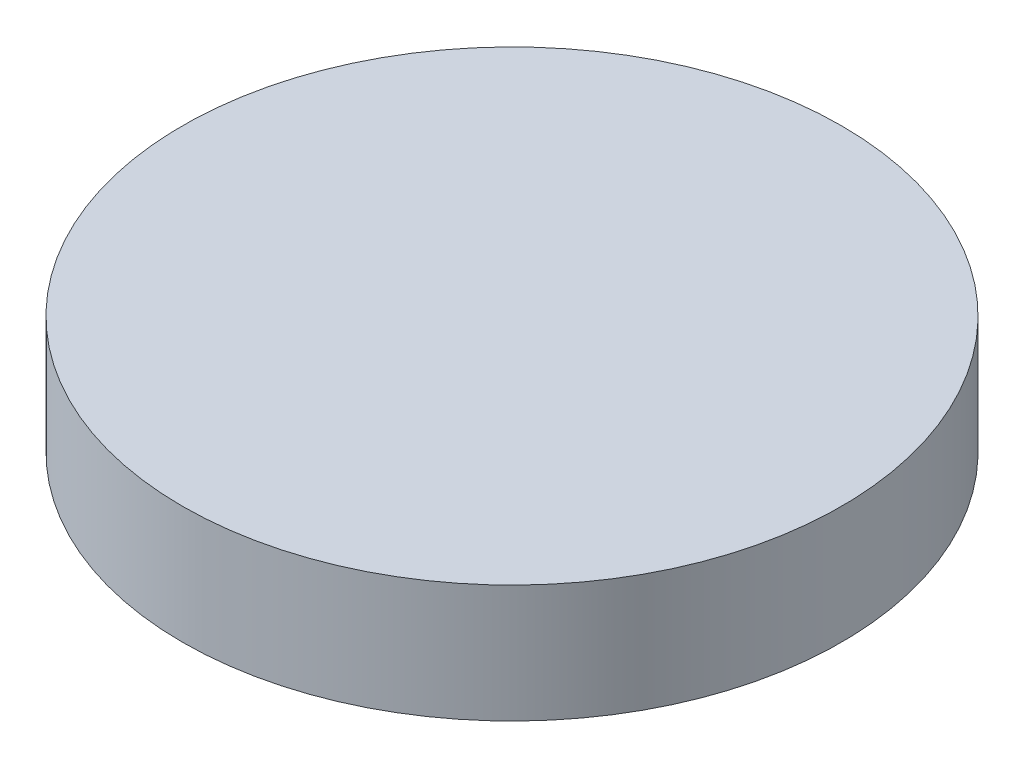
ISO-10303-21;
HEADER;
FILE_DESCRIPTION(('STEP AP214'),'2;1');
FILE_NAME('part.step','',(''),(''),'','','');
FILE_SCHEMA(('AUTOMOTIVE_DESIGN { 1 0 10303 214 1 1 1 1 }'));
ENDSEC;
DATA;
#1=APPLICATION_CONTEXT('core data for automotive mechanical design processes');
#2=APPLICATION_PROTOCOL_DEFINITION('international standard','automotive_design',2000,#1);
#3=PRODUCT_CONTEXT('',#1,'mechanical');
#4=PRODUCT('Part','Part','',(#3));
#5=PRODUCT_RELATED_PRODUCT_CATEGORY('part','',(#4));
#6=PRODUCT_DEFINITION_FORMATION('','',#4);
#7=PRODUCT_DEFINITION_CONTEXT('part definition',#1,'design');
#8=PRODUCT_DEFINITION('design','',#6,#7);
#9=PRODUCT_DEFINITION_SHAPE('','',#8);
#10=(LENGTH_UNIT() NAMED_UNIT(*) SI_UNIT(.MILLI.,.METRE.));
#11=(NAMED_UNIT(*) PLANE_ANGLE_UNIT() SI_UNIT($,.RADIAN.));
#12=(NAMED_UNIT(*) SI_UNIT($,.STERADIAN.) SOLID_ANGLE_UNIT());
#13=UNCERTAINTY_MEASURE_WITH_UNIT(LENGTH_MEASURE(1.E-05),#10,'distance_accuracy_value','');
#14=(GEOMETRIC_REPRESENTATION_CONTEXT(3) GLOBAL_UNCERTAINTY_ASSIGNED_CONTEXT((#13)) GLOBAL_UNIT_ASSIGNED_CONTEXT((#10,
#11,#12)) REPRESENTATION_CONTEXT('',''));
#15=CARTESIAN_POINT('',(0.,0.,0.));
#16=DIRECTION('',(0.,0.,1.));
#17=DIRECTION('',(1.,0.,0.));
#18=AXIS2_PLACEMENT_3D('',#15,#16,#17);
#19=CARTESIAN_POINT('',(0.,10.,0.));
#20=DIRECTION('',(0.,-1.,0.));
#21=DIRECTION('',(0.,0.,-1.));
#22=AXIS2_PLACEMENT_3D('',#19,#20,#21);
#23=CYLINDRICAL_SURFACE('',#22,27.985);
#24=CARTESIAN_POINT('',(0.,10.,0.));
#25=DIRECTION('',(0.,1.,0.));
#26=DIRECTION('',(0.,0.,1.));
#27=AXIS2_PLACEMENT_3D('',#24,#25,#26);
#28=CIRCLE('',#27,27.985);
#29=CARTESIAN_POINT('',(0.,10.,27.985));
#30=VERTEX_POINT('',#29);
#31=EDGE_CURVE('E10',#30,#30,#28,.T.);
#32=ORIENTED_EDGE('',*,*,#31,.F.);
#33=EDGE_LOOP('',(#32));
#34=FACE_BOUND('',#33,.T.);
#35=CARTESIAN_POINT('',(0.,0.,0.));
#36=DIRECTION('',(0.,1.,0.));
#37=DIRECTION('',(0.,0.,1.));
#38=AXIS2_PLACEMENT_3D('',#35,#36,#37);
#39=CIRCLE('',#38,27.985);
#40=CARTESIAN_POINT('',(0.,0.,27.985));
#41=VERTEX_POINT('',#40);
#42=EDGE_CURVE('E40',#41,#41,#39,.T.);
#43=ORIENTED_EDGE('',*,*,#42,.T.);
#44=EDGE_LOOP('',(#43));
#45=FACE_BOUND('',#44,.T.);
#46=ADVANCED_FACE('F37',(#34,#45),#23,.T.);
#47=CARTESIAN_POINT('',(0.,10.,0.));
#48=DIRECTION('',(0.,1.,0.));
#49=DIRECTION('',(0.,0.,1.));
#50=AXIS2_PLACEMENT_3D('',#47,#48,#49);
#51=PLANE('',#50);
#52=ORIENTED_EDGE('',*,*,#31,.T.);
#53=EDGE_LOOP('',(#52));
#54=FACE_BOUND('',#53,.T.);
#55=ADVANCED_FACE('F54',(#54),#51,.T.);
#56=CARTESIAN_POINT('',(0.,0.,0.));
#57=DIRECTION('',(0.,1.,0.));
#58=DIRECTION('',(0.,0.,1.));
#59=AXIS2_PLACEMENT_3D('',#56,#57,#58);
#60=PLANE('',#59);
#61=ORIENTED_EDGE('',*,*,#42,.F.);
#62=EDGE_LOOP('',(#61));
#63=FACE_BOUND('',#62,.T.);
#64=ADVANCED_FACE('F52',(#63),#60,.F.);
#65=CLOSED_SHELL('',(#46,#55,#64));
#66=MANIFOLD_SOLID_BREP('B2',#65);
#67=ADVANCED_BREP_SHAPE_REPRESENTATION('',(#18,#66),#14);
#68=SHAPE_DEFINITION_REPRESENTATION(#9,#67);
ENDSEC;
END-ISO-10303-21;
